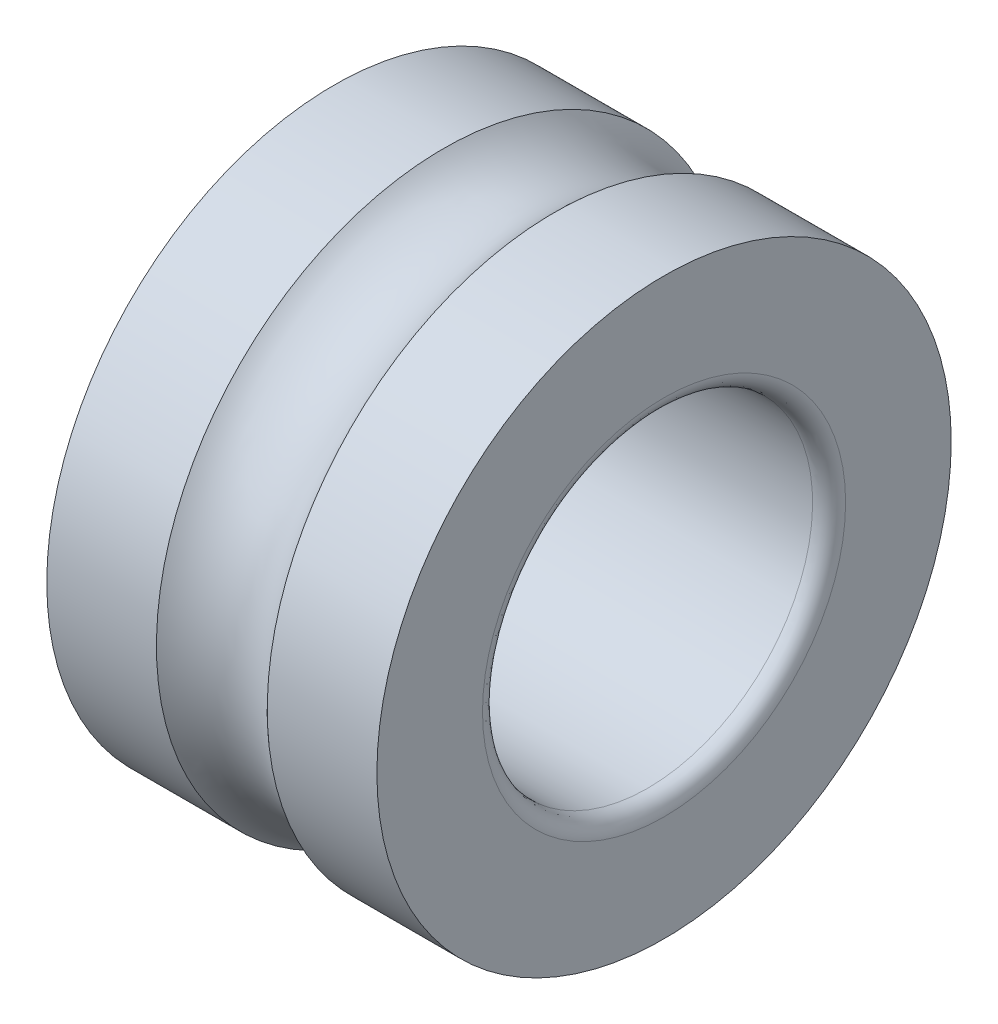
ISO-10303-21;
HEADER;
FILE_DESCRIPTION(('STEP AP214'),'2;1');
FILE_NAME('part.step','',(''),(''),'','','');
FILE_SCHEMA(('AUTOMOTIVE_DESIGN { 1 0 10303 214 1 1 1 1 }'));
ENDSEC;
DATA;
#1=APPLICATION_CONTEXT('core data for automotive mechanical design processes');
#2=APPLICATION_PROTOCOL_DEFINITION('international standard','automotive_design',2000,#1);
#3=PRODUCT_CONTEXT('',#1,'mechanical');
#4=PRODUCT('Part','Part','',(#3));
#5=PRODUCT_RELATED_PRODUCT_CATEGORY('part','',(#4));
#6=PRODUCT_DEFINITION_FORMATION('','',#4);
#7=PRODUCT_DEFINITION_CONTEXT('part definition',#1,'design');
#8=PRODUCT_DEFINITION('design','',#6,#7);
#9=PRODUCT_DEFINITION_SHAPE('','',#8);
#10=(LENGTH_UNIT() NAMED_UNIT(*) SI_UNIT(.MILLI.,.METRE.));
#11=(NAMED_UNIT(*) PLANE_ANGLE_UNIT() SI_UNIT($,.RADIAN.));
#12=(NAMED_UNIT(*) SI_UNIT($,.STERADIAN.) SOLID_ANGLE_UNIT());
#13=UNCERTAINTY_MEASURE_WITH_UNIT(LENGTH_MEASURE(1.E-05),#10,'distance_accuracy_value','');
#14=(GEOMETRIC_REPRESENTATION_CONTEXT(3) GLOBAL_UNCERTAINTY_ASSIGNED_CONTEXT((#13)) GLOBAL_UNIT_ASSIGNED_CONTEXT((#10,
#11,#12)) REPRESENTATION_CONTEXT('',''));
#15=CARTESIAN_POINT('',(0.,0.,0.));
#16=DIRECTION('',(0.,0.,1.));
#17=DIRECTION('',(1.,0.,0.));
#18=AXIS2_PLACEMENT_3D('',#15,#16,#17);
#19=CARTESIAN_POINT('',(1.17651034160326,0.,0.));
#20=DIRECTION('',(1.,0.,0.));
#21=DIRECTION('',(0.,0.,-1.));
#22=AXIS2_PLACEMENT_3D('',#19,#20,#21);
#23=CYLINDRICAL_SURFACE('',#22,6.0984892);
#24=CARTESIAN_POINT('',(3.5052,0.,0.));
#25=DIRECTION('',(1.,0.,0.));
#26=DIRECTION('',(0.,0.,-1.));
#27=AXIS2_PLACEMENT_3D('',#24,#25,#26);
#28=CIRCLE('',#27,6.0984892);
#29=CARTESIAN_POINT('',(3.5052,0.,-6.0984892));
#30=VERTEX_POINT('',#29);
#31=EDGE_CURVE('E53',#30,#30,#28,.F.);
#32=ORIENTED_EDGE('',*,*,#31,.T.);
#33=EDGE_LOOP('',(#32));
#34=FACE_BOUND('',#33,.T.);
#35=CARTESIAN_POINT('',(1.17651034160323,0.,0.));
#36=DIRECTION('',(1.,0.,0.));
#37=DIRECTION('',(0.,-1.,0.));
#38=AXIS2_PLACEMENT_3D('',#35,#36,#37);
#39=CIRCLE('',#38,6.09848920000003);
#40=CARTESIAN_POINT('',(1.17651034160323,-6.09848920000003,0.));
#41=VERTEX_POINT('',#40);
#42=EDGE_CURVE('E52',#41,#41,#39,.T.);
#43=ORIENTED_EDGE('',*,*,#42,.T.);
#44=EDGE_LOOP('',(#43));
#45=FACE_BOUND('',#44,.T.);
#46=ADVANCED_FACE('F16',(#34,#45),#23,.T.);
#47=CARTESIAN_POINT('',(3.5052,6.342428768,6.3487834370534));
#48=DIRECTION('',(1.,0.,0.));
#49=DIRECTION('',(0.,-1.,0.));
#50=AXIS2_PLACEMENT_3D('',#47,#48,#49);
#51=PLANE('',#50);
#52=CARTESIAN_POINT('',(3.50519999999999,0.,0.));
#53=DIRECTION('',(1.,0.,0.));
#54=DIRECTION('',(0.,-1.,0.));
#55=AXIS2_PLACEMENT_3D('',#52,#53,#54);
#56=CIRCLE('',#55,3.85572);
#57=CARTESIAN_POINT('',(3.5052,3.85572,0.));
#58=VERTEX_POINT('',#57);
#59=CARTESIAN_POINT('',(3.5052,-3.85572,0.));
#60=VERTEX_POINT('',#59);
#61=EDGE_CURVE('E50',#58,#60,#56,.F.);
#62=ORIENTED_EDGE('',*,*,#61,.T.);
#63=CARTESIAN_POINT('',(3.50519999999999,0.,0.));
#64=DIRECTION('',(1.,0.,0.));
#65=DIRECTION('',(0.,1.,0.));
#66=AXIS2_PLACEMENT_3D('',#63,#64,#65);
#67=CIRCLE('',#66,3.85572);
#68=EDGE_CURVE('E44',#60,#58,#67,.F.);
#69=ORIENTED_EDGE('',*,*,#68,.T.);
#70=EDGE_LOOP('',(#62,#69));
#71=FACE_BOUND('',#70,.T.);
#72=ORIENTED_EDGE('',*,*,#31,.F.);
#73=EDGE_LOOP('',(#72));
#74=FACE_BOUND('',#73,.T.);
#75=ADVANCED_FACE('F56',(#71,#74),#51,.T.);
#76=CARTESIAN_POINT('',(1.21259923880649,-6.13649830560483,0.));
#77=CARTESIAN_POINT('',(0.515154192542791,-5.37814101789699,0.));
#78=CARTESIAN_POINT('',(-0.515154192542645,-5.37814101789695,0.));
#79=CARTESIAN_POINT('',(-1.2125992388064,-6.13649830560473,0.));
#80=(BOUNDED_CURVE() B_SPLINE_CURVE(3,(#76,#77,#78,#79),.UNSPECIFIED.,.F.,
.F.) B_SPLINE_CURVE_WITH_KNOTS((4,4),(0.,1.),
.UNSPECIFIED.) CURVE() GEOMETRIC_REPRESENTATION_ITEM() RATIONAL_B_SPLINE_CURVE((1.,
0.784618958983425,0.784618958983425,1.)) REPRESENTATION_ITEM(''));
#81=CARTESIAN_POINT('',(0.,0.,0.));
#82=DIRECTION('',(1.,0.,0.));
#83=AXIS1_PLACEMENT('',#81,#82);
#84=SURFACE_OF_REVOLUTION('',#80,#83);
#85=ORIENTED_EDGE('',*,*,#42,.F.);
#86=EDGE_LOOP('',(#85));
#87=FACE_BOUND('',#86,.T.);
#88=CARTESIAN_POINT('',(-1.17651034160326,0.,0.));
#89=DIRECTION('',(1.,0.,0.));
#90=DIRECTION('',(0.,-1.,0.));
#91=AXIS2_PLACEMENT_3D('',#88,#89,#90);
#92=CIRCLE('',#91,6.0984892);
#93=CARTESIAN_POINT('',(-1.17651034160326,-6.0984892,0.));
#94=VERTEX_POINT('',#93);
#95=EDGE_CURVE('E58',#94,#94,#92,.T.);
#96=ORIENTED_EDGE('',*,*,#95,.T.);
#97=EDGE_LOOP('',(#96));
#98=FACE_BOUND('',#97,.T.);
#99=ADVANCED_FACE('F73',(#87,#98),#84,.F.);
#100=CARTESIAN_POINT('',(3.50311341424621,-3.89390934716281,0.));
#101=CARTESIAN_POINT('',(3.52956905609088,-3.65253235858235,0.));
#102=CARTESIAN_POINT('',(3.35786764141764,-3.48083094390911,0.));
#103=CARTESIAN_POINT('',(3.11649065283718,-3.50728658575379,0.));
#104=(BOUNDED_CURVE() B_SPLINE_CURVE(3,(#100,#101,#102,#103),.UNSPECIFIED.,.F.,
.F.) B_SPLINE_CURVE_WITH_KNOTS((4,4),(0.,1.),
.UNSPECIFIED.) CURVE() GEOMETRIC_REPRESENTATION_ITEM() RATIONAL_B_SPLINE_CURVE((1.,
0.750571881124366,0.750571881124366,1.)) REPRESENTATION_ITEM(''));
#105=CARTESIAN_POINT('',(3.15468,0.,0.));
#106=DIRECTION('',(1.,0.,0.));
#107=AXIS1_PLACEMENT('',#105,#106);
#108=SURFACE_OF_REVOLUTION('',#104,#107);
#109=ORIENTED_EDGE('',*,*,#61,.F.);
#110=ORIENTED_EDGE('',*,*,#68,.F.);
#111=EDGE_LOOP('',(#109,#110));
#112=FACE_BOUND('',#111,.T.);
#113=CARTESIAN_POINT('',(3.15468,0.,0.));
#114=DIRECTION('',(1.,0.,0.));
#115=DIRECTION('',(0.,-1.,0.));
#116=AXIS2_PLACEMENT_3D('',#113,#114,#115);
#117=CIRCLE('',#116,3.5052);
#118=CARTESIAN_POINT('',(3.15468,-3.5052,0.));
#119=VERTEX_POINT('',#118);
#120=EDGE_CURVE('E104',#119,#119,#117,.F.);
#121=ORIENTED_EDGE('',*,*,#120,.T.);
#122=EDGE_LOOP('',(#121));
#123=FACE_BOUND('',#122,.T.);
#124=ADVANCED_FACE('F48',(#112,#123),#108,.T.);
#125=CARTESIAN_POINT('',(-3.5052,0.,0.));
#126=DIRECTION('',(1.,0.,0.));
#127=DIRECTION('',(0.,0.,-1.));
#128=AXIS2_PLACEMENT_3D('',#125,#126,#127);
#129=CYLINDRICAL_SURFACE('',#128,6.0984892);
#130=ORIENTED_EDGE('',*,*,#95,.F.);
#131=EDGE_LOOP('',(#130));
#132=FACE_BOUND('',#131,.T.);
#133=CARTESIAN_POINT('',(-3.5052,0.,0.));
#134=DIRECTION('',(1.,0.,0.));
#135=DIRECTION('',(0.,0.,-1.));
#136=AXIS2_PLACEMENT_3D('',#133,#134,#135);
#137=CIRCLE('',#136,6.0984892);
#138=CARTESIAN_POINT('',(-3.5052,0.,-6.0984892));
#139=VERTEX_POINT('',#138);
#140=EDGE_CURVE('E96',#139,#139,#137,.T.);
#141=ORIENTED_EDGE('',*,*,#140,.T.);
#142=EDGE_LOOP('',(#141));
#143=FACE_BOUND('',#142,.T.);
#144=ADVANCED_FACE('F150',(#132,#143),#129,.T.);
#145=CARTESIAN_POINT('',(-3.15468,0.,0.));
#146=DIRECTION('',(1.,0.,0.));
#147=DIRECTION('',(0.,0.,-1.));
#148=AXIS2_PLACEMENT_3D('',#145,#146,#147);
#149=CYLINDRICAL_SURFACE('',#148,3.5052);
#150=ORIENTED_EDGE('',*,*,#120,.F.);
#151=EDGE_LOOP('',(#150));
#152=FACE_BOUND('',#151,.T.);
#153=CARTESIAN_POINT('',(-3.15468,0.,0.));
#154=DIRECTION('',(1.,0.,0.));
#155=DIRECTION('',(0.,-1.,0.));
#156=AXIS2_PLACEMENT_3D('',#153,#154,#155);
#157=CIRCLE('',#156,3.50520000000001);
#158=CARTESIAN_POINT('',(-3.15468,-3.50520000000001,0.));
#159=VERTEX_POINT('',#158);
#160=EDGE_CURVE('E29',#159,#159,#157,.F.);
#161=ORIENTED_EDGE('',*,*,#160,.T.);
#162=EDGE_LOOP('',(#161));
#163=FACE_BOUND('',#162,.T.);
#164=ADVANCED_FACE('F121',(#152,#163),#149,.F.);
#165=CARTESIAN_POINT('',(-3.5052,6.342428768,6.3487834370534));
#166=DIRECTION('',(1.,0.,0.));
#167=DIRECTION('',(0.,-1.,0.));
#168=AXIS2_PLACEMENT_3D('',#165,#166,#167);
#169=PLANE('',#168);
#170=CARTESIAN_POINT('',(-3.50519999999999,0.,0.));
#171=DIRECTION('',(-1.,0.,0.));
#172=DIRECTION('',(0.,-1.,0.));
#173=AXIS2_PLACEMENT_3D('',#170,#171,#172);
#174=CIRCLE('',#173,3.85572);
#175=CARTESIAN_POINT('',(-3.5052,-3.85572,0.));
#176=VERTEX_POINT('',#175);
#177=CARTESIAN_POINT('',(-3.5052,3.85572,0.));
#178=VERTEX_POINT('',#177);
#179=EDGE_CURVE('E35',#176,#178,#174,.T.);
#180=ORIENTED_EDGE('',*,*,#179,.F.);
#181=CARTESIAN_POINT('',(-3.50519999999999,0.,0.));
#182=DIRECTION('',(-1.,0.,0.));
#183=DIRECTION('',(0.,1.,0.));
#184=AXIS2_PLACEMENT_3D('',#181,#182,#183);
#185=CIRCLE('',#184,3.85572);
#186=EDGE_CURVE('E11',#176,#178,#185,.F.);
#187=ORIENTED_EDGE('',*,*,#186,.T.);
#188=EDGE_LOOP('',(#180,#187));
#189=FACE_BOUND('',#188,.T.);
#190=ORIENTED_EDGE('',*,*,#140,.F.);
#191=EDGE_LOOP('',(#190));
#192=FACE_BOUND('',#191,.T.);
#193=ADVANCED_FACE('F18',(#189,#192),#169,.F.);
#194=CARTESIAN_POINT('',(-3.11649065283719,-3.50728658575379,0.));
#195=CARTESIAN_POINT('',(-3.35786764141765,-3.48083094390912,0.));
#196=CARTESIAN_POINT('',(-3.52956905609089,-3.65253235858236,0.));
#197=CARTESIAN_POINT('',(-3.50311341424621,-3.89390934716282,0.));
#198=(BOUNDED_CURVE() B_SPLINE_CURVE(3,(#194,#195,#196,#197),.UNSPECIFIED.,.F.,
.F.) B_SPLINE_CURVE_WITH_KNOTS((4,4),(0.,1.),
.UNSPECIFIED.) CURVE() GEOMETRIC_REPRESENTATION_ITEM() RATIONAL_B_SPLINE_CURVE((1.,
0.750571881124366,0.750571881124366,1.)) REPRESENTATION_ITEM(''));
#199=CARTESIAN_POINT('',(-3.15468,0.,0.));
#200=DIRECTION('',(1.,0.,0.));
#201=AXIS1_PLACEMENT('',#199,#200);
#202=SURFACE_OF_REVOLUTION('',#198,#201);
#203=ORIENTED_EDGE('',*,*,#179,.T.);
#204=ORIENTED_EDGE('',*,*,#186,.F.);
#205=EDGE_LOOP('',(#203,#204));
#206=FACE_BOUND('',#205,.T.);
#207=ORIENTED_EDGE('',*,*,#160,.F.);
#208=EDGE_LOOP('',(#207));
#209=FACE_BOUND('',#208,.T.);
#210=ADVANCED_FACE('F111',(#206,#209),#202,.T.);
#211=CLOSED_SHELL('',(#46,#75,#99,#124,#144,#164,#193,#210));
#212=MANIFOLD_SOLID_BREP('B1',#211);
#213=ADVANCED_BREP_SHAPE_REPRESENTATION('',(#18,#212),#14);
#214=SHAPE_DEFINITION_REPRESENTATION(#9,#213);
ENDSEC;
END-ISO-10303-21;
